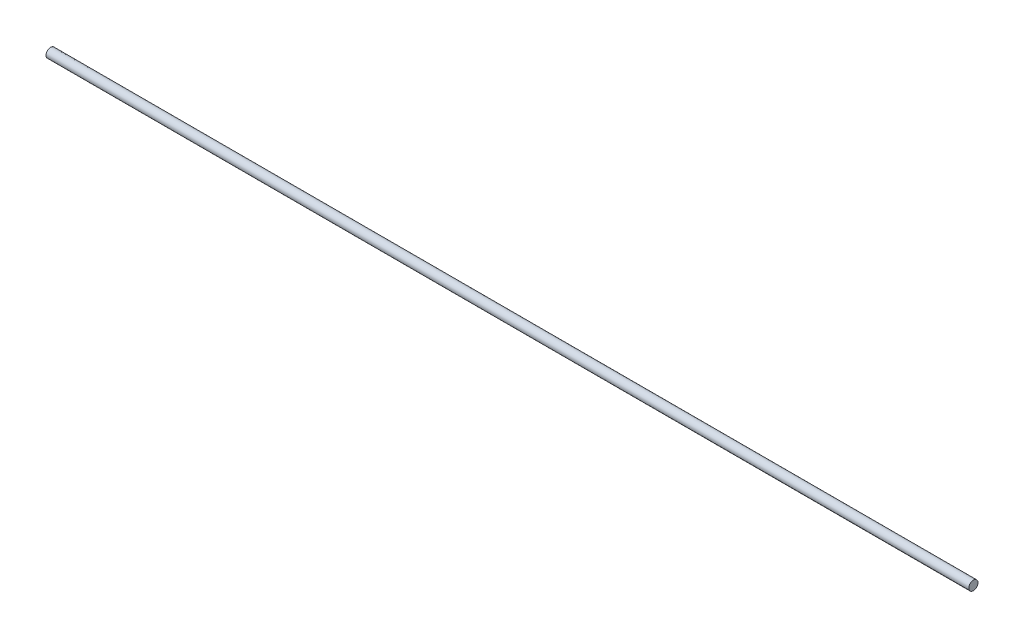
ISO-10303-21;
HEADER;
FILE_DESCRIPTION(('STEP AP214'),'2;1');
FILE_NAME('part.step','',(''),(''),'','','');
FILE_SCHEMA(('AUTOMOTIVE_DESIGN { 1 0 10303 214 1 1 1 1 }'));
ENDSEC;
DATA;
#1=APPLICATION_CONTEXT('core data for automotive mechanical design processes');
#2=APPLICATION_PROTOCOL_DEFINITION('international standard','automotive_design',2000,#1);
#3=PRODUCT_CONTEXT('',#1,'mechanical');
#4=PRODUCT('Part','Part','',(#3));
#5=PRODUCT_RELATED_PRODUCT_CATEGORY('part','',(#4));
#6=PRODUCT_DEFINITION_FORMATION('','',#4);
#7=PRODUCT_DEFINITION_CONTEXT('part definition',#1,'design');
#8=PRODUCT_DEFINITION('design','',#6,#7);
#9=PRODUCT_DEFINITION_SHAPE('','',#8);
#10=(LENGTH_UNIT() NAMED_UNIT(*) SI_UNIT(.MILLI.,.METRE.));
#11=(NAMED_UNIT(*) PLANE_ANGLE_UNIT() SI_UNIT($,.RADIAN.));
#12=(NAMED_UNIT(*) SI_UNIT($,.STERADIAN.) SOLID_ANGLE_UNIT());
#13=UNCERTAINTY_MEASURE_WITH_UNIT(LENGTH_MEASURE(1.E-05),#10,'distance_accuracy_value','');
#14=(GEOMETRIC_REPRESENTATION_CONTEXT(3) GLOBAL_UNCERTAINTY_ASSIGNED_CONTEXT((#13)) GLOBAL_UNIT_ASSIGNED_CONTEXT((#10,
#11,#12)) REPRESENTATION_CONTEXT('',''));
#15=CARTESIAN_POINT('',(0.,0.,0.));
#16=DIRECTION('',(0.,0.,1.));
#17=DIRECTION('',(1.,0.,0.));
#18=AXIS2_PLACEMENT_3D('',#15,#16,#17);
#19=CARTESIAN_POINT('',(800.,0.,0.));
#20=DIRECTION('',(-1.,0.,0.));
#21=DIRECTION('',(0.,0.,1.));
#22=AXIS2_PLACEMENT_3D('',#19,#20,#21);
#23=CYLINDRICAL_SURFACE('',#22,4.);
#24=CARTESIAN_POINT('',(800.,0.,0.));
#25=DIRECTION('',(1.,0.,0.));
#26=DIRECTION('',(0.,0.,-1.));
#27=AXIS2_PLACEMENT_3D('',#24,#25,#26);
#28=CIRCLE('',#27,4.);
#29=CARTESIAN_POINT('',(800.,0.,-4.));
#30=VERTEX_POINT('',#29);
#31=EDGE_CURVE('E10',#30,#30,#28,.T.);
#32=ORIENTED_EDGE('',*,*,#31,.F.);
#33=EDGE_LOOP('',(#32));
#34=FACE_BOUND('',#33,.T.);
#35=CARTESIAN_POINT('',(0.,0.,0.));
#36=DIRECTION('',(1.,0.,0.));
#37=DIRECTION('',(0.,0.,-1.));
#38=AXIS2_PLACEMENT_3D('',#35,#36,#37);
#39=CIRCLE('',#38,4.);
#40=CARTESIAN_POINT('',(0.,0.,-4.));
#41=VERTEX_POINT('',#40);
#42=EDGE_CURVE('E35',#41,#41,#39,.T.);
#43=ORIENTED_EDGE('',*,*,#42,.T.);
#44=EDGE_LOOP('',(#43));
#45=FACE_BOUND('',#44,.T.);
#46=ADVANCED_FACE('F32',(#34,#45),#23,.T.);
#47=CARTESIAN_POINT('',(800.,0.,0.));
#48=DIRECTION('',(1.,0.,0.));
#49=DIRECTION('',(0.,0.,-1.));
#50=AXIS2_PLACEMENT_3D('',#47,#48,#49);
#51=PLANE('',#50);
#52=ORIENTED_EDGE('',*,*,#31,.T.);
#53=EDGE_LOOP('',(#52));
#54=FACE_BOUND('',#53,.T.);
#55=ADVANCED_FACE('F47',(#54),#51,.T.);
#56=CARTESIAN_POINT('',(0.,0.,0.));
#57=DIRECTION('',(1.,0.,0.));
#58=DIRECTION('',(0.,0.,-1.));
#59=AXIS2_PLACEMENT_3D('',#56,#57,#58);
#60=PLANE('',#59);
#61=ORIENTED_EDGE('',*,*,#42,.F.);
#62=EDGE_LOOP('',(#61));
#63=FACE_BOUND('',#62,.T.);
#64=ADVANCED_FACE('F45',(#63),#60,.F.);
#65=CLOSED_SHELL('',(#46,#55,#64));
#66=MANIFOLD_SOLID_BREP('B2',#65);
#67=ADVANCED_BREP_SHAPE_REPRESENTATION('',(#18,#66),#14);
#68=SHAPE_DEFINITION_REPRESENTATION(#9,#67);
ENDSEC;
END-ISO-10303-21;
